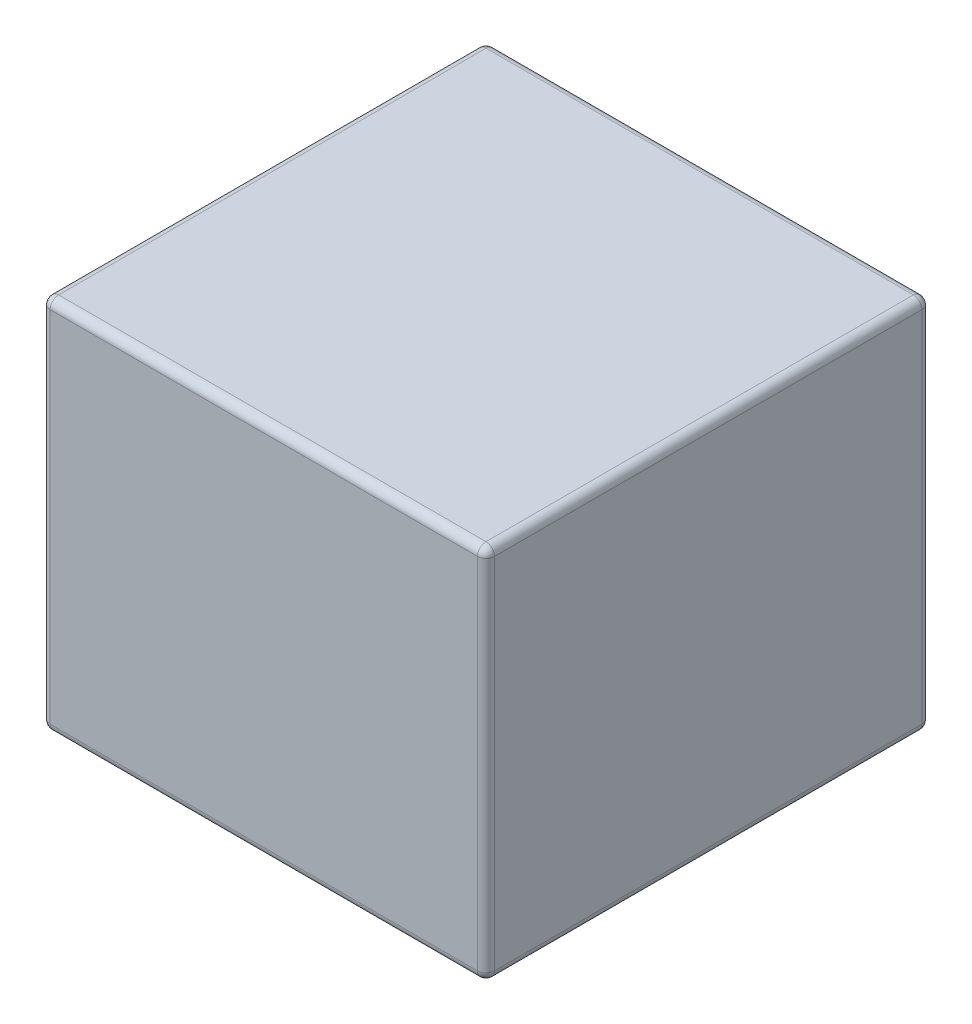
ISO-10303-21;
HEADER;
FILE_DESCRIPTION(('STEP AP214'),'2;1');
FILE_NAME('part.step','',(''),(''),'','','');
FILE_SCHEMA(('AUTOMOTIVE_DESIGN { 1 0 10303 214 1 1 1 1 }'));
ENDSEC;
DATA;
#1=APPLICATION_CONTEXT('core data for automotive mechanical design processes');
#2=APPLICATION_PROTOCOL_DEFINITION('international standard','automotive_design',2000,#1);
#3=PRODUCT_CONTEXT('',#1,'mechanical');
#4=PRODUCT('Part','Part','',(#3));
#5=PRODUCT_RELATED_PRODUCT_CATEGORY('part','',(#4));
#6=PRODUCT_DEFINITION_FORMATION('','',#4);
#7=PRODUCT_DEFINITION_CONTEXT('part definition',#1,'design');
#8=PRODUCT_DEFINITION('design','',#6,#7);
#9=PRODUCT_DEFINITION_SHAPE('','',#8);
#10=(LENGTH_UNIT() NAMED_UNIT(*) SI_UNIT(.MILLI.,.METRE.));
#11=(NAMED_UNIT(*) PLANE_ANGLE_UNIT() SI_UNIT($,.RADIAN.));
#12=(NAMED_UNIT(*) SI_UNIT($,.STERADIAN.) SOLID_ANGLE_UNIT());
#13=UNCERTAINTY_MEASURE_WITH_UNIT(LENGTH_MEASURE(1.E-05),#10,'distance_accuracy_value','');
#14=(GEOMETRIC_REPRESENTATION_CONTEXT(3) GLOBAL_UNCERTAINTY_ASSIGNED_CONTEXT((#13)) GLOBAL_UNIT_ASSIGNED_CONTEXT((#10,
#11,#12)) REPRESENTATION_CONTEXT('',''));
#15=CARTESIAN_POINT('',(0.,0.,0.));
#16=DIRECTION('',(0.,0.,1.));
#17=DIRECTION('',(1.,0.,0.));
#18=AXIS2_PLACEMENT_3D('',#15,#16,#17);
#19=CARTESIAN_POINT('',(0.,279.4,0.));
#20=DIRECTION('',(1.,0.,0.));
#21=DIRECTION('',(0.,0.,-1.));
#22=AXIS2_PLACEMENT_3D('',#19,#20,#21);
#23=PLANE('',#22);
#24=DIRECTION('',(0.,-1.,0.));
#25=VECTOR('',#24,1.);
#26=CARTESIAN_POINT('',(0.,279.4,-323.85));
#27=LINE('',#26,#25);
#28=CARTESIAN_POINT('',(0.,273.05,-323.85));
#29=VERTEX_POINT('',#28);
#30=CARTESIAN_POINT('',(0.,6.35000000000002,-323.85));
#31=VERTEX_POINT('',#30);
#32=EDGE_CURVE('E129',#29,#31,#27,.T.);
#33=ORIENTED_EDGE('',*,*,#32,.T.);
#34=DIRECTION('',(0.,0.,1.));
#35=VECTOR('',#34,1.);
#36=CARTESIAN_POINT('',(0.,6.35000000000002,0.));
#37=LINE('',#36,#35);
#38=CARTESIAN_POINT('',(0.,6.35000000000002,-6.35));
#39=VERTEX_POINT('',#38);
#40=EDGE_CURVE('E125',#31,#39,#37,.T.);
#41=ORIENTED_EDGE('',*,*,#40,.T.);
#42=DIRECTION('',(0.,-1.,0.));
#43=VECTOR('',#42,1.);
#44=CARTESIAN_POINT('',(0.,279.4,-6.35));
#45=LINE('',#44,#43);
#46=CARTESIAN_POINT('',(0.,273.05,-6.35));
#47=VERTEX_POINT('',#46);
#48=EDGE_CURVE('E120',#39,#47,#45,.F.);
#49=ORIENTED_EDGE('',*,*,#48,.T.);
#50=DIRECTION('',(0.,0.,1.));
#51=VECTOR('',#50,1.);
#52=CARTESIAN_POINT('',(0.,273.05,0.));
#53=LINE('',#52,#51);
#54=EDGE_CURVE('E122',#47,#29,#53,.F.);
#55=ORIENTED_EDGE('',*,*,#54,.T.);
#56=EDGE_LOOP('',(#33,#41,#49,#55));
#57=FACE_BOUND('',#56,.T.);
#58=ADVANCED_FACE('F32',(#57),#23,.F.);
#59=CARTESIAN_POINT('',(0.,279.4,0.));
#60=DIRECTION('',(0.,0.,-1.));
#61=DIRECTION('',(-1.,0.,0.));
#62=AXIS2_PLACEMENT_3D('',#59,#60,#61);
#63=PLANE('',#62);
#64=DIRECTION('',(0.,-1.,0.));
#65=VECTOR('',#64,1.);
#66=CARTESIAN_POINT('',(6.35,279.4,0.));
#67=LINE('',#66,#65);
#68=CARTESIAN_POINT('',(6.35,273.05,0.));
#69=VERTEX_POINT('',#68);
#70=CARTESIAN_POINT('',(6.35,6.35000000000002,0.));
#71=VERTEX_POINT('',#70);
#72=EDGE_CURVE('E151',#69,#71,#67,.T.);
#73=ORIENTED_EDGE('',*,*,#72,.T.);
#74=DIRECTION('',(1.,0.,0.));
#75=VECTOR('',#74,1.);
#76=CARTESIAN_POINT('',(330.2,6.35000000000002,0.));
#77=LINE('',#76,#75);
#78=CARTESIAN_POINT('',(323.85,6.35000000000002,0.));
#79=VERTEX_POINT('',#78);
#80=EDGE_CURVE('E229',#71,#79,#77,.T.);
#81=ORIENTED_EDGE('',*,*,#80,.T.);
#82=DIRECTION('',(0.,-1.,0.));
#83=VECTOR('',#82,1.);
#84=CARTESIAN_POINT('',(323.85,279.4,0.));
#85=LINE('',#84,#83);
#86=CARTESIAN_POINT('',(323.85,273.05,0.));
#87=VERTEX_POINT('',#86);
#88=EDGE_CURVE('E222',#79,#87,#85,.F.);
#89=ORIENTED_EDGE('',*,*,#88,.T.);
#90=DIRECTION('',(1.,0.,0.));
#91=VECTOR('',#90,1.);
#92=CARTESIAN_POINT('',(0.,273.05,0.));
#93=LINE('',#92,#91);
#94=EDGE_CURVE('E220',#87,#69,#93,.F.);
#95=ORIENTED_EDGE('',*,*,#94,.T.);
#96=EDGE_LOOP('',(#73,#81,#89,#95));
#97=FACE_BOUND('',#96,.T.);
#98=ADVANCED_FACE('F319',(#97),#63,.F.);
#99=CARTESIAN_POINT('',(330.2,279.4,0.));
#100=DIRECTION('',(-1.,0.,0.));
#101=DIRECTION('',(0.,0.,1.));
#102=AXIS2_PLACEMENT_3D('',#99,#100,#101);
#103=PLANE('',#102);
#104=DIRECTION('',(0.,0.,-1.));
#105=VECTOR('',#104,1.);
#106=CARTESIAN_POINT('',(330.2,6.35000000000002,-330.2));
#107=LINE('',#106,#105);
#108=CARTESIAN_POINT('',(330.2,6.35000000000002,-6.35));
#109=VERTEX_POINT('',#108);
#110=CARTESIAN_POINT('',(330.2,6.35000000000002,-323.85));
#111=VERTEX_POINT('',#110);
#112=EDGE_CURVE('E216',#109,#111,#107,.T.);
#113=ORIENTED_EDGE('',*,*,#112,.T.);
#114=DIRECTION('',(0.,-1.,0.));
#115=VECTOR('',#114,1.);
#116=CARTESIAN_POINT('',(330.2,279.4,-323.85));
#117=LINE('',#116,#115);
#118=CARTESIAN_POINT('',(330.2,273.05,-323.85));
#119=VERTEX_POINT('',#118);
#120=EDGE_CURVE('E213',#111,#119,#117,.F.);
#121=ORIENTED_EDGE('',*,*,#120,.T.);
#122=DIRECTION('',(0.,0.,-1.));
#123=VECTOR('',#122,1.);
#124=CARTESIAN_POINT('',(330.2,273.05,0.));
#125=LINE('',#124,#123);
#126=CARTESIAN_POINT('',(330.2,273.05,-6.35));
#127=VERTEX_POINT('',#126);
#128=EDGE_CURVE('E206',#119,#127,#125,.F.);
#129=ORIENTED_EDGE('',*,*,#128,.T.);
#130=DIRECTION('',(0.,-1.,0.));
#131=VECTOR('',#130,1.);
#132=CARTESIAN_POINT('',(330.2,279.4,-6.35));
#133=LINE('',#132,#131);
#134=EDGE_CURVE('E209',#127,#109,#133,.T.);
#135=ORIENTED_EDGE('',*,*,#134,.T.);
#136=EDGE_LOOP('',(#113,#121,#129,#135));
#137=FACE_BOUND('',#136,.T.);
#138=ADVANCED_FACE('F214',(#137),#103,.F.);
#139=CARTESIAN_POINT('',(0.,279.4,-330.2));
#140=DIRECTION('',(0.,0.,1.));
#141=DIRECTION('',(1.,0.,0.));
#142=AXIS2_PLACEMENT_3D('',#139,#140,#141);
#143=PLANE('',#142);
#144=DIRECTION('',(-1.,0.,0.));
#145=VECTOR('',#144,1.);
#146=CARTESIAN_POINT('',(0.,6.35000000000002,-330.2));
#147=LINE('',#146,#145);
#148=CARTESIAN_POINT('',(323.85,6.35000000000002,-330.2));
#149=VERTEX_POINT('',#148);
#150=CARTESIAN_POINT('',(6.35,6.35000000000002,-330.2));
#151=VERTEX_POINT('',#150);
#152=EDGE_CURVE('E278',#149,#151,#147,.T.);
#153=ORIENTED_EDGE('',*,*,#152,.T.);
#154=DIRECTION('',(0.,-1.,0.));
#155=VECTOR('',#154,1.);
#156=CARTESIAN_POINT('',(6.35,279.4,-330.2));
#157=LINE('',#156,#155);
#158=CARTESIAN_POINT('',(6.35,273.05,-330.2));
#159=VERTEX_POINT('',#158);
#160=EDGE_CURVE('E210',#151,#159,#157,.F.);
#161=ORIENTED_EDGE('',*,*,#160,.T.);
#162=DIRECTION('',(-1.,0.,0.));
#163=VECTOR('',#162,1.);
#164=CARTESIAN_POINT('',(0.,273.05,-330.2));
#165=LINE('',#164,#163);
#166=CARTESIAN_POINT('',(323.85,273.05,-330.2));
#167=VERTEX_POINT('',#166);
#168=EDGE_CURVE('E271',#159,#167,#165,.F.);
#169=ORIENTED_EDGE('',*,*,#168,.T.);
#170=DIRECTION('',(0.,-1.,0.));
#171=VECTOR('',#170,1.);
#172=CARTESIAN_POINT('',(323.85,279.4,-330.2));
#173=LINE('',#172,#171);
#174=EDGE_CURVE('E273',#167,#149,#173,.T.);
#175=ORIENTED_EDGE('',*,*,#174,.T.);
#176=EDGE_LOOP('',(#153,#161,#169,#175));
#177=FACE_BOUND('',#176,.T.);
#178=ADVANCED_FACE('F303',(#177),#143,.F.);
#179=CARTESIAN_POINT('',(0.,279.4,0.));
#180=DIRECTION('',(0.,-1.,0.));
#181=DIRECTION('',(0.,0.,-1.));
#182=AXIS2_PLACEMENT_3D('',#179,#180,#181);
#183=PLANE('',#182);
#184=DIRECTION('',(0.,0.,-1.));
#185=VECTOR('',#184,1.);
#186=CARTESIAN_POINT('',(323.85,279.4,0.));
#187=LINE('',#186,#185);
#188=CARTESIAN_POINT('',(323.85,279.4,-6.35));
#189=VERTEX_POINT('',#188);
#190=CARTESIAN_POINT('',(323.85,279.4,-323.85));
#191=VERTEX_POINT('',#190);
#192=EDGE_CURVE('E41',#189,#191,#187,.T.);
#193=ORIENTED_EDGE('',*,*,#192,.T.);
#194=DIRECTION('',(-1.,0.,0.));
#195=VECTOR('',#194,1.);
#196=CARTESIAN_POINT('',(0.,279.4,-323.85));
#197=LINE('',#196,#195);
#198=CARTESIAN_POINT('',(6.35,279.4,-323.85));
#199=VERTEX_POINT('',#198);
#200=EDGE_CURVE('E11',#191,#199,#197,.T.);
#201=ORIENTED_EDGE('',*,*,#200,.T.);
#202=DIRECTION('',(0.,0.,1.));
#203=VECTOR('',#202,1.);
#204=CARTESIAN_POINT('',(6.35,279.4,0.));
#205=LINE('',#204,#203);
#206=CARTESIAN_POINT('',(6.35,279.4,-6.35));
#207=VERTEX_POINT('',#206);
#208=EDGE_CURVE('E231',#199,#207,#205,.T.);
#209=ORIENTED_EDGE('',*,*,#208,.T.);
#210=DIRECTION('',(1.,0.,0.));
#211=VECTOR('',#210,1.);
#212=CARTESIAN_POINT('',(0.,279.4,-6.35));
#213=LINE('',#212,#211);
#214=EDGE_CURVE('E52',#207,#189,#213,.T.);
#215=ORIENTED_EDGE('',*,*,#214,.T.);
#216=EDGE_LOOP('',(#193,#201,#209,#215));
#217=FACE_BOUND('',#216,.T.);
#218=ADVANCED_FACE('F482',(#217),#183,.F.);
#219=CARTESIAN_POINT('',(0.,0.,0.));
#220=DIRECTION('',(0.,-1.,0.));
#221=DIRECTION('',(0.,0.,-1.));
#222=AXIS2_PLACEMENT_3D('',#219,#220,#221);
#223=PLANE('',#222);
#224=DIRECTION('',(1.,0.,0.));
#225=VECTOR('',#224,1.);
#226=CARTESIAN_POINT('',(0.,0.,-6.35));
#227=LINE('',#226,#225);
#228=CARTESIAN_POINT('',(323.85,0.,-6.35));
#229=VERTEX_POINT('',#228);
#230=CARTESIAN_POINT('',(6.35,0.,-6.35));
#231=VERTEX_POINT('',#230);
#232=EDGE_CURVE('E267',#229,#231,#227,.F.);
#233=ORIENTED_EDGE('',*,*,#232,.T.);
#234=DIRECTION('',(0.,0.,1.));
#235=VECTOR('',#234,1.);
#236=CARTESIAN_POINT('',(6.35,0.,-330.2));
#237=LINE('',#236,#235);
#238=CARTESIAN_POINT('',(6.35,0.,-323.85));
#239=VERTEX_POINT('',#238);
#240=EDGE_CURVE('E261',#231,#239,#237,.F.);
#241=ORIENTED_EDGE('',*,*,#240,.T.);
#242=DIRECTION('',(-1.,0.,0.));
#243=VECTOR('',#242,1.);
#244=CARTESIAN_POINT('',(330.2,0.,-323.85));
#245=LINE('',#244,#243);
#246=CARTESIAN_POINT('',(323.85,0.,-323.85));
#247=VERTEX_POINT('',#246);
#248=EDGE_CURVE('E255',#239,#247,#245,.F.);
#249=ORIENTED_EDGE('',*,*,#248,.T.);
#250=DIRECTION('',(0.,0.,-1.));
#251=VECTOR('',#250,1.);
#252=CARTESIAN_POINT('',(323.85,0.,0.));
#253=LINE('',#252,#251);
#254=EDGE_CURVE('E262',#247,#229,#253,.F.);
#255=ORIENTED_EDGE('',*,*,#254,.T.);
#256=EDGE_LOOP('',(#233,#241,#249,#255));
#257=FACE_BOUND('',#256,.T.);
#258=ADVANCED_FACE('F265',(#257),#223,.T.);
#259=CARTESIAN_POINT('',(323.85,273.05,0.));
#260=DIRECTION('',(0.,0.,-1.));
#261=DIRECTION('',(-1.,0.,0.));
#262=AXIS2_PLACEMENT_3D('',#259,#260,#261);
#263=CYLINDRICAL_SURFACE('',#262,6.35);
#264=CARTESIAN_POINT('',(323.85,273.05,-323.85));
#265=DIRECTION('',(0.,0.,-1.));
#266=DIRECTION('',(-1.,0.,0.));
#267=AXIS2_PLACEMENT_3D('',#264,#265,#266);
#268=CIRCLE('',#267,6.35);
#269=EDGE_CURVE('E36',#191,#119,#268,.T.);
#270=ORIENTED_EDGE('',*,*,#269,.F.);
#271=ORIENTED_EDGE('',*,*,#192,.F.);
#272=CARTESIAN_POINT('',(323.85,273.05,-6.35));
#273=DIRECTION('',(0.,0.,1.));
#274=DIRECTION('',(1.,0.,0.));
#275=AXIS2_PLACEMENT_3D('',#272,#273,#274);
#276=CIRCLE('',#275,6.35);
#277=EDGE_CURVE('E191',#127,#189,#276,.T.);
#278=ORIENTED_EDGE('',*,*,#277,.F.);
#279=ORIENTED_EDGE('',*,*,#128,.F.);
#280=EDGE_LOOP('',(#270,#271,#278,#279));
#281=FACE_BOUND('',#280,.T.);
#282=ADVANCED_FACE('F34',(#281),#263,.T.);
#283=CARTESIAN_POINT('',(323.85,273.05,-323.85));
#284=DIRECTION('',(0.,0.,1.));
#285=DIRECTION('',(1.,0.,0.));
#286=AXIS2_PLACEMENT_3D('',#283,#284,#285);
#287=SPHERICAL_SURFACE('',#286,6.35);
#288=CARTESIAN_POINT('',(323.85,273.05,-323.85));
#289=DIRECTION('',(1.,0.,0.));
#290=DIRECTION('',(0.,0.,-1.));
#291=AXIS2_PLACEMENT_3D('',#288,#289,#290);
#292=CIRCLE('',#291,6.35);
#293=EDGE_CURVE('E187',#191,#167,#292,.F.);
#294=ORIENTED_EDGE('',*,*,#293,.F.);
#295=ORIENTED_EDGE('',*,*,#269,.T.);
#296=CARTESIAN_POINT('',(323.85,273.05,-323.85));
#297=DIRECTION('',(0.,1.,0.));
#298=DIRECTION('',(0.,0.,1.));
#299=AXIS2_PLACEMENT_3D('',#296,#297,#298);
#300=CIRCLE('',#299,6.35);
#301=EDGE_CURVE('E190',#167,#119,#300,.F.);
#302=ORIENTED_EDGE('',*,*,#301,.F.);
#303=EDGE_LOOP('',(#294,#295,#302));
#304=FACE_BOUND('',#303,.T.);
#305=ADVANCED_FACE('F202',(#304),#287,.T.);
#306=CARTESIAN_POINT('',(323.85,273.05,-6.35));
#307=DIRECTION('',(0.,0.,1.));
#308=DIRECTION('',(1.,0.,0.));
#309=AXIS2_PLACEMENT_3D('',#306,#307,#308);
#310=SPHERICAL_SURFACE('',#309,6.35);
#311=CARTESIAN_POINT('',(323.85,273.05,-6.35));
#312=DIRECTION('',(0.,1.,0.));
#313=DIRECTION('',(0.,0.,1.));
#314=AXIS2_PLACEMENT_3D('',#311,#312,#313);
#315=CIRCLE('',#314,6.35);
#316=EDGE_CURVE('E181',#127,#87,#315,.F.);
#317=ORIENTED_EDGE('',*,*,#316,.F.);
#318=ORIENTED_EDGE('',*,*,#277,.T.);
#319=CARTESIAN_POINT('',(323.85,273.05,-6.35));
#320=DIRECTION('',(1.,0.,0.));
#321=DIRECTION('',(0.,0.,-1.));
#322=AXIS2_PLACEMENT_3D('',#319,#320,#321);
#323=CIRCLE('',#322,6.35);
#324=EDGE_CURVE('E184',#87,#189,#323,.F.);
#325=ORIENTED_EDGE('',*,*,#324,.F.);
#326=EDGE_LOOP('',(#317,#318,#325));
#327=FACE_BOUND('',#326,.T.);
#328=ADVANCED_FACE('F455',(#327),#310,.T.);
#329=CARTESIAN_POINT('',(323.85,279.4,-323.85));
#330=DIRECTION('',(0.,-1.,0.));
#331=DIRECTION('',(0.,0.,-1.));
#332=AXIS2_PLACEMENT_3D('',#329,#330,#331);
#333=CYLINDRICAL_SURFACE('',#332,6.35);
#334=ORIENTED_EDGE('',*,*,#301,.T.);
#335=ORIENTED_EDGE('',*,*,#120,.F.);
#336=CARTESIAN_POINT('',(323.85,6.35000000000002,-323.85));
#337=DIRECTION('',(0.,-1.,0.));
#338=DIRECTION('',(0.,0.,-1.));
#339=AXIS2_PLACEMENT_3D('',#336,#337,#338);
#340=CIRCLE('',#339,6.35);
#341=EDGE_CURVE('E175',#149,#111,#340,.T.);
#342=ORIENTED_EDGE('',*,*,#341,.F.);
#343=ORIENTED_EDGE('',*,*,#174,.F.);
#344=EDGE_LOOP('',(#334,#335,#342,#343));
#345=FACE_BOUND('',#344,.T.);
#346=ADVANCED_FACE('F305',(#345),#333,.T.);
#347=CARTESIAN_POINT('',(0.,273.05,-323.85));
#348=DIRECTION('',(-1.,0.,0.));
#349=DIRECTION('',(0.,0.,1.));
#350=AXIS2_PLACEMENT_3D('',#347,#348,#349);
#351=CYLINDRICAL_SURFACE('',#350,6.35);
#352=ORIENTED_EDGE('',*,*,#293,.T.);
#353=ORIENTED_EDGE('',*,*,#168,.F.);
#354=CARTESIAN_POINT('',(6.35,273.05,-323.85));
#355=DIRECTION('',(-1.,0.,0.));
#356=DIRECTION('',(0.,0.,1.));
#357=AXIS2_PLACEMENT_3D('',#354,#355,#356);
#358=CIRCLE('',#357,6.35);
#359=EDGE_CURVE('E172',#199,#159,#358,.T.);
#360=ORIENTED_EDGE('',*,*,#359,.F.);
#361=ORIENTED_EDGE('',*,*,#200,.F.);
#362=EDGE_LOOP('',(#352,#353,#360,#361));
#363=FACE_BOUND('',#362,.T.);
#364=ADVANCED_FACE('F439',(#363),#351,.T.);
#365=CARTESIAN_POINT('',(6.35,273.05,0.));
#366=DIRECTION('',(0.,0.,1.));
#367=DIRECTION('',(1.,0.,0.));
#368=AXIS2_PLACEMENT_3D('',#365,#366,#367);
#369=CYLINDRICAL_SURFACE('',#368,6.35);
#370=CARTESIAN_POINT('',(6.35,273.05,-6.35));
#371=DIRECTION('',(0.,0.,1.));
#372=DIRECTION('',(1.,0.,0.));
#373=AXIS2_PLACEMENT_3D('',#370,#371,#372);
#374=CIRCLE('',#373,6.35);
#375=EDGE_CURVE('E136',#207,#47,#374,.T.);
#376=ORIENTED_EDGE('',*,*,#375,.F.);
#377=ORIENTED_EDGE('',*,*,#208,.F.);
#378=CARTESIAN_POINT('',(6.35,273.05,-323.85));
#379=DIRECTION('',(0.,0.,-1.));
#380=DIRECTION('',(-1.,0.,0.));
#381=AXIS2_PLACEMENT_3D('',#378,#379,#380);
#382=CIRCLE('',#381,6.35);
#383=EDGE_CURVE('E138',#29,#199,#382,.T.);
#384=ORIENTED_EDGE('',*,*,#383,.F.);
#385=ORIENTED_EDGE('',*,*,#54,.F.);
#386=EDGE_LOOP('',(#376,#377,#384,#385));
#387=FACE_BOUND('',#386,.T.);
#388=ADVANCED_FACE('F134',(#387),#369,.T.);
#389=CARTESIAN_POINT('',(0.,273.05,-6.35));
#390=DIRECTION('',(1.,0.,0.));
#391=DIRECTION('',(0.,0.,-1.));
#392=AXIS2_PLACEMENT_3D('',#389,#390,#391);
#393=CYLINDRICAL_SURFACE('',#392,6.35);
#394=ORIENTED_EDGE('',*,*,#324,.T.);
#395=ORIENTED_EDGE('',*,*,#214,.F.);
#396=CARTESIAN_POINT('',(6.35,273.05,-6.35));
#397=DIRECTION('',(-1.,0.,0.));
#398=DIRECTION('',(0.,0.,1.));
#399=AXIS2_PLACEMENT_3D('',#396,#397,#398);
#400=CIRCLE('',#399,6.35);
#401=EDGE_CURVE('E147',#69,#207,#400,.T.);
#402=ORIENTED_EDGE('',*,*,#401,.F.);
#403=ORIENTED_EDGE('',*,*,#94,.F.);
#404=EDGE_LOOP('',(#394,#395,#402,#403));
#405=FACE_BOUND('',#404,.T.);
#406=ADVANCED_FACE('F423',(#405),#393,.T.);
#407=CARTESIAN_POINT('',(323.85,279.4,-6.35));
#408=DIRECTION('',(0.,-1.,0.));
#409=DIRECTION('',(0.,0.,-1.));
#410=AXIS2_PLACEMENT_3D('',#407,#408,#409);
#411=CYLINDRICAL_SURFACE('',#410,6.35);
#412=ORIENTED_EDGE('',*,*,#316,.T.);
#413=ORIENTED_EDGE('',*,*,#88,.F.);
#414=CARTESIAN_POINT('',(323.85,6.35000000000002,-6.35));
#415=DIRECTION('',(0.,-1.,0.));
#416=DIRECTION('',(0.,0.,-1.));
#417=AXIS2_PLACEMENT_3D('',#414,#415,#416);
#418=CIRCLE('',#417,6.35);
#419=EDGE_CURVE('E167',#109,#79,#418,.T.);
#420=ORIENTED_EDGE('',*,*,#419,.F.);
#421=ORIENTED_EDGE('',*,*,#134,.F.);
#422=EDGE_LOOP('',(#412,#413,#420,#421));
#423=FACE_BOUND('',#422,.T.);
#424=ADVANCED_FACE('F289',(#423),#411,.T.);
#425=CARTESIAN_POINT('',(323.85,6.35000000000002,0.));
#426=DIRECTION('',(0.,0.,1.));
#427=DIRECTION('',(1.,0.,0.));
#428=AXIS2_PLACEMENT_3D('',#425,#426,#427);
#429=CYLINDRICAL_SURFACE('',#428,6.35);
#430=CARTESIAN_POINT('',(323.85,6.35000000000002,-323.85));
#431=DIRECTION('',(0.,0.,-1.));
#432=DIRECTION('',(-1.,0.,0.));
#433=AXIS2_PLACEMENT_3D('',#430,#431,#432);
#434=CIRCLE('',#433,6.35);
#435=EDGE_CURVE('E178',#111,#247,#434,.T.);
#436=ORIENTED_EDGE('',*,*,#435,.F.);
#437=ORIENTED_EDGE('',*,*,#112,.F.);
#438=CARTESIAN_POINT('',(323.85,6.35,-6.35));
#439=DIRECTION('',(0.,0.,1.));
#440=DIRECTION('',(1.,0.,0.));
#441=AXIS2_PLACEMENT_3D('',#438,#439,#440);
#442=CIRCLE('',#441,6.35);
#443=EDGE_CURVE('E164',#229,#109,#442,.T.);
#444=ORIENTED_EDGE('',*,*,#443,.F.);
#445=ORIENTED_EDGE('',*,*,#254,.F.);
#446=EDGE_LOOP('',(#436,#437,#444,#445));
#447=FACE_BOUND('',#446,.T.);
#448=ADVANCED_FACE('F286',(#447),#429,.T.);
#449=CARTESIAN_POINT('',(323.85,6.35,-323.85));
#450=DIRECTION('',(0.,0.,1.));
#451=DIRECTION('',(1.,0.,0.));
#452=AXIS2_PLACEMENT_3D('',#449,#450,#451);
#453=SPHERICAL_SURFACE('',#452,6.35);
#454=ORIENTED_EDGE('',*,*,#341,.T.);
#455=ORIENTED_EDGE('',*,*,#435,.T.);
#456=CARTESIAN_POINT('',(323.85,6.35,-323.85));
#457=DIRECTION('',(1.,0.,0.));
#458=DIRECTION('',(0.,0.,-1.));
#459=AXIS2_PLACEMENT_3D('',#456,#457,#458);
#460=CIRCLE('',#459,6.35);
#461=EDGE_CURVE('E155',#149,#247,#460,.F.);
#462=ORIENTED_EDGE('',*,*,#461,.F.);
#463=EDGE_LOOP('',(#454,#455,#462));
#464=FACE_BOUND('',#463,.T.);
#465=ADVANCED_FACE('F307',(#464),#453,.T.);
#466=CARTESIAN_POINT('',(6.35,273.05,-323.85));
#467=DIRECTION('',(0.,0.,1.));
#468=DIRECTION('',(1.,0.,0.));
#469=AXIS2_PLACEMENT_3D('',#466,#467,#468);
#470=SPHERICAL_SURFACE('',#469,6.35);
#471=ORIENTED_EDGE('',*,*,#383,.T.);
#472=ORIENTED_EDGE('',*,*,#359,.T.);
#473=CARTESIAN_POINT('',(6.35,273.05,-323.85));
#474=DIRECTION('',(0.,1.,0.));
#475=DIRECTION('',(0.,0.,1.));
#476=AXIS2_PLACEMENT_3D('',#473,#474,#475);
#477=CIRCLE('',#476,6.35);
#478=EDGE_CURVE('E152',#29,#159,#477,.F.);
#479=ORIENTED_EDGE('',*,*,#478,.F.);
#480=EDGE_LOOP('',(#471,#472,#479));
#481=FACE_BOUND('',#480,.T.);
#482=ADVANCED_FACE('F309',(#481),#470,.T.);
#483=CARTESIAN_POINT('',(6.35,273.05,-6.35));
#484=DIRECTION('',(0.,0.,1.));
#485=DIRECTION('',(1.,0.,0.));
#486=AXIS2_PLACEMENT_3D('',#483,#484,#485);
#487=SPHERICAL_SURFACE('',#486,6.35);
#488=ORIENTED_EDGE('',*,*,#401,.T.);
#489=ORIENTED_EDGE('',*,*,#375,.T.);
#490=CARTESIAN_POINT('',(6.35,273.05,-6.35));
#491=DIRECTION('',(0.,1.,0.));
#492=DIRECTION('',(0.,0.,1.));
#493=AXIS2_PLACEMENT_3D('',#490,#491,#492);
#494=CIRCLE('',#493,6.35);
#495=EDGE_CURVE('E144',#69,#47,#494,.F.);
#496=ORIENTED_EDGE('',*,*,#495,.F.);
#497=EDGE_LOOP('',(#488,#489,#496));
#498=FACE_BOUND('',#497,.T.);
#499=ADVANCED_FACE('F143',(#498),#487,.T.);
#500=CARTESIAN_POINT('',(323.85,6.35,-6.35));
#501=DIRECTION('',(0.,0.,1.));
#502=DIRECTION('',(1.,0.,0.));
#503=AXIS2_PLACEMENT_3D('',#500,#501,#502);
#504=SPHERICAL_SURFACE('',#503,6.35);
#505=ORIENTED_EDGE('',*,*,#443,.T.);
#506=ORIENTED_EDGE('',*,*,#419,.T.);
#507=CARTESIAN_POINT('',(323.85,6.35000000000002,-6.35));
#508=DIRECTION('',(1.,0.,0.));
#509=DIRECTION('',(0.,0.,-1.));
#510=AXIS2_PLACEMENT_3D('',#507,#508,#509);
#511=CIRCLE('',#510,6.35);
#512=EDGE_CURVE('E153',#229,#79,#511,.F.);
#513=ORIENTED_EDGE('',*,*,#512,.F.);
#514=EDGE_LOOP('',(#505,#506,#513));
#515=FACE_BOUND('',#514,.T.);
#516=ADVANCED_FACE('F291',(#515),#504,.T.);
#517=CARTESIAN_POINT('',(0.,6.35000000000002,-323.85));
#518=DIRECTION('',(1.,0.,0.));
#519=DIRECTION('',(0.,0.,-1.));
#520=AXIS2_PLACEMENT_3D('',#517,#518,#519);
#521=CYLINDRICAL_SURFACE('',#520,6.35);
#522=ORIENTED_EDGE('',*,*,#461,.T.);
#523=ORIENTED_EDGE('',*,*,#248,.F.);
#524=CARTESIAN_POINT('',(6.35,6.35000000000002,-323.85));
#525=DIRECTION('',(-1.,0.,0.));
#526=DIRECTION('',(0.,0.,1.));
#527=AXIS2_PLACEMENT_3D('',#524,#525,#526);
#528=CIRCLE('',#527,6.35);
#529=EDGE_CURVE('E158',#151,#239,#528,.T.);
#530=ORIENTED_EDGE('',*,*,#529,.F.);
#531=ORIENTED_EDGE('',*,*,#152,.F.);
#532=EDGE_LOOP('',(#522,#523,#530,#531));
#533=FACE_BOUND('',#532,.T.);
#534=ADVANCED_FACE('F257',(#533),#521,.T.);
#535=CARTESIAN_POINT('',(6.35,279.4,-323.85));
#536=DIRECTION('',(0.,-1.,0.));
#537=DIRECTION('',(0.,0.,-1.));
#538=AXIS2_PLACEMENT_3D('',#535,#536,#537);
#539=CYLINDRICAL_SURFACE('',#538,6.35);
#540=ORIENTED_EDGE('',*,*,#478,.T.);
#541=ORIENTED_EDGE('',*,*,#160,.F.);
#542=CARTESIAN_POINT('',(6.35,6.35000000000002,-323.85));
#543=DIRECTION('',(0.,-1.,0.));
#544=DIRECTION('',(0.,0.,-1.));
#545=AXIS2_PLACEMENT_3D('',#542,#543,#544);
#546=CIRCLE('',#545,6.35);
#547=EDGE_CURVE('E244',#31,#151,#546,.T.);
#548=ORIENTED_EDGE('',*,*,#547,.F.);
#549=ORIENTED_EDGE('',*,*,#32,.F.);
#550=EDGE_LOOP('',(#540,#541,#548,#549));
#551=FACE_BOUND('',#550,.T.);
#552=ADVANCED_FACE('F301',(#551),#539,.T.);
#553=CARTESIAN_POINT('',(6.35,279.4,-6.35));
#554=DIRECTION('',(0.,-1.,0.));
#555=DIRECTION('',(0.,0.,-1.));
#556=AXIS2_PLACEMENT_3D('',#553,#554,#555);
#557=CYLINDRICAL_SURFACE('',#556,6.35);
#558=ORIENTED_EDGE('',*,*,#495,.T.);
#559=ORIENTED_EDGE('',*,*,#48,.F.);
#560=CARTESIAN_POINT('',(6.35,6.35000000000002,-6.35));
#561=DIRECTION('',(0.,-1.,0.));
#562=DIRECTION('',(0.,0.,-1.));
#563=AXIS2_PLACEMENT_3D('',#560,#561,#562);
#564=CIRCLE('',#563,6.35);
#565=EDGE_CURVE('E241',#71,#39,#564,.T.);
#566=ORIENTED_EDGE('',*,*,#565,.F.);
#567=ORIENTED_EDGE('',*,*,#72,.F.);
#568=EDGE_LOOP('',(#558,#559,#566,#567));
#569=FACE_BOUND('',#568,.T.);
#570=ADVANCED_FACE('F149',(#569),#557,.T.);
#571=CARTESIAN_POINT('',(0.,6.35000000000002,-6.35));
#572=DIRECTION('',(-1.,0.,0.));
#573=DIRECTION('',(0.,0.,1.));
#574=AXIS2_PLACEMENT_3D('',#571,#572,#573);
#575=CYLINDRICAL_SURFACE('',#574,6.35);
#576=ORIENTED_EDGE('',*,*,#512,.T.);
#577=ORIENTED_EDGE('',*,*,#80,.F.);
#578=CARTESIAN_POINT('',(6.35,6.35,-6.35));
#579=DIRECTION('',(-1.,0.,0.));
#580=DIRECTION('',(0.,0.,1.));
#581=AXIS2_PLACEMENT_3D('',#578,#579,#580);
#582=CIRCLE('',#581,6.35);
#583=EDGE_CURVE('E239',#231,#71,#582,.T.);
#584=ORIENTED_EDGE('',*,*,#583,.F.);
#585=ORIENTED_EDGE('',*,*,#232,.F.);
#586=EDGE_LOOP('',(#576,#577,#584,#585));
#587=FACE_BOUND('',#586,.T.);
#588=ADVANCED_FACE('F294',(#587),#575,.T.);
#589=CARTESIAN_POINT('',(6.35,6.35,-323.85));
#590=DIRECTION('',(0.,0.,1.));
#591=DIRECTION('',(1.,0.,0.));
#592=AXIS2_PLACEMENT_3D('',#589,#590,#591);
#593=SPHERICAL_SURFACE('',#592,6.35);
#594=ORIENTED_EDGE('',*,*,#547,.T.);
#595=ORIENTED_EDGE('',*,*,#529,.T.);
#596=CARTESIAN_POINT('',(6.35,6.35,-323.85));
#597=DIRECTION('',(0.,0.,-1.));
#598=DIRECTION('',(-1.,0.,0.));
#599=AXIS2_PLACEMENT_3D('',#596,#597,#598);
#600=CIRCLE('',#599,6.35);
#601=EDGE_CURVE('E237',#31,#239,#600,.F.);
#602=ORIENTED_EDGE('',*,*,#601,.F.);
#603=EDGE_LOOP('',(#594,#595,#602));
#604=FACE_BOUND('',#603,.T.);
#605=ADVANCED_FACE('F251',(#604),#593,.T.);
#606=CARTESIAN_POINT('',(6.35,6.35,-6.35));
#607=DIRECTION('',(0.,0.,1.));
#608=DIRECTION('',(1.,0.,0.));
#609=AXIS2_PLACEMENT_3D('',#606,#607,#608);
#610=SPHERICAL_SURFACE('',#609,6.35);
#611=ORIENTED_EDGE('',*,*,#583,.T.);
#612=ORIENTED_EDGE('',*,*,#565,.T.);
#613=CARTESIAN_POINT('',(6.35,6.35000000000002,-6.35));
#614=DIRECTION('',(0.,0.,1.));
#615=DIRECTION('',(1.,0.,0.));
#616=AXIS2_PLACEMENT_3D('',#613,#614,#615);
#617=CIRCLE('',#616,6.35);
#618=EDGE_CURVE('E235',#231,#39,#617,.F.);
#619=ORIENTED_EDGE('',*,*,#618,.F.);
#620=EDGE_LOOP('',(#611,#612,#619));
#621=FACE_BOUND('',#620,.T.);
#622=ADVANCED_FACE('F331',(#621),#610,.T.);
#623=CARTESIAN_POINT('',(6.35,6.35000000000002,0.));
#624=DIRECTION('',(0.,0.,-1.));
#625=DIRECTION('',(-1.,0.,0.));
#626=AXIS2_PLACEMENT_3D('',#623,#624,#625);
#627=CYLINDRICAL_SURFACE('',#626,6.35);
#628=ORIENTED_EDGE('',*,*,#601,.T.);
#629=ORIENTED_EDGE('',*,*,#240,.F.);
#630=ORIENTED_EDGE('',*,*,#618,.T.);
#631=ORIENTED_EDGE('',*,*,#40,.F.);
#632=EDGE_LOOP('',(#628,#629,#630,#631));
#633=FACE_BOUND('',#632,.T.);
#634=ADVANCED_FACE('F328',(#633),#627,.T.);
#635=CLOSED_SHELL('',(#58,#98,#138,#178,#218,#258,#282,#305,#328,#346,#364,#388,#406,#424,#448,
#465,#482,#499,#516,#534,#552,#570,#588,#605,#622,#634));
#636=MANIFOLD_SOLID_BREP('B2',#635);
#637=ADVANCED_BREP_SHAPE_REPRESENTATION('',(#18,#636),#14);
#638=SHAPE_DEFINITION_REPRESENTATION(#9,#637);
ENDSEC;
END-ISO-10303-21;
